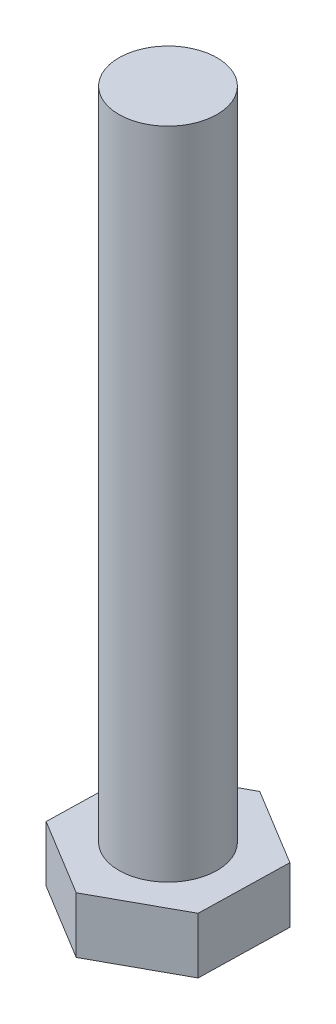
ISO-10303-21;
HEADER;
FILE_DESCRIPTION(('STEP AP214'),'2;1');
FILE_NAME('part.step','',(''),(''),'','','');
FILE_SCHEMA(('AUTOMOTIVE_DESIGN { 1 0 10303 214 1 1 1 1 }'));
ENDSEC;
DATA;
#1=APPLICATION_CONTEXT('core data for automotive mechanical design processes');
#2=APPLICATION_PROTOCOL_DEFINITION('international standard','automotive_design',2000,#1);
#3=PRODUCT_CONTEXT('',#1,'mechanical');
#4=PRODUCT('Part','Part','',(#3));
#5=PRODUCT_RELATED_PRODUCT_CATEGORY('part','',(#4));
#6=PRODUCT_DEFINITION_FORMATION('','',#4);
#7=PRODUCT_DEFINITION_CONTEXT('part definition',#1,'design');
#8=PRODUCT_DEFINITION('design','',#6,#7);
#9=PRODUCT_DEFINITION_SHAPE('','',#8);
#10=(LENGTH_UNIT() NAMED_UNIT(*) SI_UNIT(.MILLI.,.METRE.));
#11=(NAMED_UNIT(*) PLANE_ANGLE_UNIT() SI_UNIT($,.RADIAN.));
#12=(NAMED_UNIT(*) SI_UNIT($,.STERADIAN.) SOLID_ANGLE_UNIT());
#13=UNCERTAINTY_MEASURE_WITH_UNIT(LENGTH_MEASURE(1.E-05),#10,'distance_accuracy_value','');
#14=(GEOMETRIC_REPRESENTATION_CONTEXT(3) GLOBAL_UNCERTAINTY_ASSIGNED_CONTEXT((#13)) GLOBAL_UNIT_ASSIGNED_CONTEXT((#10,
#11,#12)) REPRESENTATION_CONTEXT('',''));
#15=CARTESIAN_POINT('',(0.,0.,0.));
#16=DIRECTION('',(0.,0.,1.));
#17=DIRECTION('',(1.,0.,0.));
#18=AXIS2_PLACEMENT_3D('',#15,#16,#17);
#19=CARTESIAN_POINT('',(0.,8.,0.));
#20=DIRECTION('',(0.,1.,0.));
#21=DIRECTION('',(0.,0.,1.));
#22=AXIS2_PLACEMENT_3D('',#19,#20,#21);
#23=PLANE('',#22);
#24=DIRECTION('',(0.87704358070201,0.,-0.4804108216406));
#25=VECTOR('',#24,1.);
#26=CARTESIAN_POINT('',(-0.246529994803016,8.,10.9668845300292));
#27=LINE('',#26,#25);
#28=CARTESIAN_POINT('',(-0.246529994803016,8.,10.9668845300292));
#29=VERTEX_POINT('',#28);
#30=CARTESIAN_POINT('',(9.37433560597435,8.,5.69694350330886));
#31=VERTEX_POINT('',#30);
#32=EDGE_CURVE('E118',#29,#31,#27,.T.);
#33=ORIENTED_EDGE('',*,*,#32,.T.);
#34=DIRECTION('',(0.0224738145572902,0.,-0.999747431934308));
#35=VECTOR('',#34,1.);
#36=CARTESIAN_POINT('',(9.37433560597435,8.,5.69694350330886));
#37=LINE('',#36,#35);
#38=CARTESIAN_POINT('',(9.62086560077736,8.,-5.26994102672035));
#39=VERTEX_POINT('',#38);
#40=EDGE_CURVE('E107',#31,#39,#37,.T.);
#41=ORIENTED_EDGE('',*,*,#40,.T.);
#42=DIRECTION('',(-0.85456976614472,0.,-0.519336610293708));
#43=VECTOR('',#42,1.);
#44=CARTESIAN_POINT('',(9.62086560077736,8.,-5.26994102672035));
#45=LINE('',#44,#43);
#46=CARTESIAN_POINT('',(0.246529994803018,8.,-10.9668845300292));
#47=VERTEX_POINT('',#46);
#48=EDGE_CURVE('E117',#39,#47,#45,.T.);
#49=ORIENTED_EDGE('',*,*,#48,.T.);
#50=DIRECTION('',(-0.87704358070201,0.,0.4804108216406));
#51=VECTOR('',#50,1.);
#52=CARTESIAN_POINT('',(0.246529994803018,8.,-10.9668845300292));
#53=LINE('',#52,#51);
#54=CARTESIAN_POINT('',(-9.37433560597434,8.,-5.69694350330886));
#55=VERTEX_POINT('',#54);
#56=EDGE_CURVE('E186',#47,#55,#53,.T.);
#57=ORIENTED_EDGE('',*,*,#56,.T.);
#58=DIRECTION('',(-0.0224738145572905,0.,0.999747431934308));
#59=VECTOR('',#58,1.);
#60=CARTESIAN_POINT('',(-9.37433560597434,8.,-5.69694350330886));
#61=LINE('',#60,#59);
#62=CARTESIAN_POINT('',(-9.62086560077736,8.,5.26994102672035));
#63=VERTEX_POINT('',#62);
#64=EDGE_CURVE('E188',#55,#63,#61,.T.);
#65=ORIENTED_EDGE('',*,*,#64,.T.);
#66=DIRECTION('',(0.85456976614472,0.,0.519336610293708));
#67=VECTOR('',#66,1.);
#68=CARTESIAN_POINT('',(-9.62086560077736,8.,5.26994102672035));
#69=LINE('',#68,#67);
#70=EDGE_CURVE('E123',#63,#29,#69,.T.);
#71=ORIENTED_EDGE('',*,*,#70,.T.);
#72=EDGE_LOOP('',(#33,#41,#49,#57,#65,#71));
#73=FACE_BOUND('',#72,.T.);
#74=CARTESIAN_POINT('',(0.,8.,0.));
#75=DIRECTION('',(0.,1.,0.));
#76=DIRECTION('',(0.,0.,1.));
#77=AXIS2_PLACEMENT_3D('',#74,#75,#76);
#78=CIRCLE('',#77,6.);
#79=CARTESIAN_POINT('',(0.,8.,6.));
#80=VERTEX_POINT('',#79);
#81=EDGE_CURVE('E174',#80,#80,#78,.T.);
#82=ORIENTED_EDGE('',*,*,#81,.F.);
#83=EDGE_LOOP('',(#82));
#84=FACE_BOUND('',#83,.T.);
#85=ADVANCED_FACE('F34',(#73,#84),#23,.T.);
#86=CARTESIAN_POINT('',(-0.246529994803016,8.,10.9668845300292));
#87=DIRECTION('',(-0.4804108216406,0.,-0.87704358070201));
#88=DIRECTION('',(-0.87704358070201,0.,0.4804108216406));
#89=AXIS2_PLACEMENT_3D('',#86,#87,#88);
#90=PLANE('',#89);
#91=DIRECTION('',(0.,-1.,0.));
#92=VECTOR('',#91,1.);
#93=CARTESIAN_POINT('',(-0.246529994803016,8.,10.9668845300292));
#94=LINE('',#93,#92);
#95=CARTESIAN_POINT('',(-0.246529994803016,1.15470053837925,10.9668845300292));
#96=VERTEX_POINT('',#95);
#97=EDGE_CURVE('E191',#29,#96,#94,.T.);
#98=ORIENTED_EDGE('',*,*,#97,.T.);
#99=DIRECTION('',(0.87704358070201,0.,-0.4804108216406));
#100=VECTOR('',#99,1.);
#101=CARTESIAN_POINT('',(-0.246529994803016,1.15470053837925,10.9668845300292));
#102=LINE('',#101,#100);
#103=CARTESIAN_POINT('',(9.37433560597435,1.15470053837925,5.69694350330886));
#104=VERTEX_POINT('',#103);
#105=EDGE_CURVE('E131',#96,#104,#102,.T.);
#106=ORIENTED_EDGE('',*,*,#105,.T.);
#107=DIRECTION('',(0.,-1.,0.));
#108=VECTOR('',#107,1.);
#109=CARTESIAN_POINT('',(9.37433560597435,8.,5.69694350330886));
#110=LINE('',#109,#108);
#111=EDGE_CURVE('E111',#31,#104,#110,.T.);
#112=ORIENTED_EDGE('',*,*,#111,.F.);
#113=ORIENTED_EDGE('',*,*,#32,.F.);
#114=EDGE_LOOP('',(#98,#106,#112,#113));
#115=FACE_BOUND('',#114,.T.);
#116=ADVANCED_FACE('F129',(#115),#90,.F.);
#117=CARTESIAN_POINT('',(9.37433560597435,8.,5.69694350330886));
#118=DIRECTION('',(-0.999747431934308,0.,-0.0224738145572902));
#119=DIRECTION('',(-0.0224738145572902,0.,0.999747431934308));
#120=AXIS2_PLACEMENT_3D('',#117,#118,#119);
#121=PLANE('',#120);
#122=ORIENTED_EDGE('',*,*,#111,.T.);
#123=DIRECTION('',(0.0224738145572902,0.,-0.999747431934308));
#124=VECTOR('',#123,1.);
#125=CARTESIAN_POINT('',(9.37433560597435,1.15470053837925,5.69694350330886));
#126=LINE('',#125,#124);
#127=CARTESIAN_POINT('',(9.62086560077736,1.15470053837925,-5.26994102672035));
#128=VERTEX_POINT('',#127);
#129=EDGE_CURVE('E153',#104,#128,#126,.T.);
#130=ORIENTED_EDGE('',*,*,#129,.T.);
#131=DIRECTION('',(0.,-1.,0.));
#132=VECTOR('',#131,1.);
#133=CARTESIAN_POINT('',(9.62086560077736,8.,-5.26994102672035));
#134=LINE('',#133,#132);
#135=EDGE_CURVE('E114',#39,#128,#134,.T.);
#136=ORIENTED_EDGE('',*,*,#135,.F.);
#137=ORIENTED_EDGE('',*,*,#40,.F.);
#138=EDGE_LOOP('',(#122,#130,#136,#137));
#139=FACE_BOUND('',#138,.T.);
#140=ADVANCED_FACE('F109',(#139),#121,.F.);
#141=CARTESIAN_POINT('',(9.62086560077736,8.,-5.26994102672035));
#142=DIRECTION('',(-0.519336610293708,0.,0.85456976614472));
#143=DIRECTION('',(0.85456976614472,0.,0.519336610293708));
#144=AXIS2_PLACEMENT_3D('',#141,#142,#143);
#145=PLANE('',#144);
#146=ORIENTED_EDGE('',*,*,#135,.T.);
#147=DIRECTION('',(-0.85456976614472,0.,-0.519336610293708));
#148=VECTOR('',#147,1.);
#149=CARTESIAN_POINT('',(9.62086560077736,1.15470053837925,-5.26994102672035));
#150=LINE('',#149,#148);
#151=CARTESIAN_POINT('',(0.246529994803018,1.15470053837925,-10.9668845300292));
#152=VERTEX_POINT('',#151);
#153=EDGE_CURVE('E132',#128,#152,#150,.T.);
#154=ORIENTED_EDGE('',*,*,#153,.T.);
#155=DIRECTION('',(0.,-1.,0.));
#156=VECTOR('',#155,1.);
#157=CARTESIAN_POINT('',(0.246529994803018,8.,-10.9668845300292));
#158=LINE('',#157,#156);
#159=EDGE_CURVE('E137',#47,#152,#158,.T.);
#160=ORIENTED_EDGE('',*,*,#159,.F.);
#161=ORIENTED_EDGE('',*,*,#48,.F.);
#162=EDGE_LOOP('',(#146,#154,#160,#161));
#163=FACE_BOUND('',#162,.T.);
#164=ADVANCED_FACE('F200',(#163),#145,.F.);
#165=CARTESIAN_POINT('',(0.246529994803018,8.,-10.9668845300292));
#166=DIRECTION('',(0.4804108216406,0.,0.87704358070201));
#167=DIRECTION('',(0.87704358070201,0.,-0.4804108216406));
#168=AXIS2_PLACEMENT_3D('',#165,#166,#167);
#169=PLANE('',#168);
#170=ORIENTED_EDGE('',*,*,#159,.T.);
#171=DIRECTION('',(-0.87704358070201,0.,0.4804108216406));
#172=VECTOR('',#171,1.);
#173=CARTESIAN_POINT('',(0.246529994803018,1.15470053837925,-10.9668845300292));
#174=LINE('',#173,#172);
#175=CARTESIAN_POINT('',(-9.37433560597434,1.15470053837925,-5.69694350330886));
#176=VERTEX_POINT('',#175);
#177=EDGE_CURVE('E11',#152,#176,#174,.T.);
#178=ORIENTED_EDGE('',*,*,#177,.T.);
#179=DIRECTION('',(0.,-1.,0.));
#180=VECTOR('',#179,1.);
#181=CARTESIAN_POINT('',(-9.37433560597434,8.,-5.69694350330886));
#182=LINE('',#181,#180);
#183=EDGE_CURVE('E195',#55,#176,#182,.T.);
#184=ORIENTED_EDGE('',*,*,#183,.F.);
#185=ORIENTED_EDGE('',*,*,#56,.F.);
#186=EDGE_LOOP('',(#170,#178,#184,#185));
#187=FACE_BOUND('',#186,.T.);
#188=ADVANCED_FACE('F198',(#187),#169,.F.);
#189=CARTESIAN_POINT('',(-9.37433560597434,8.,-5.69694350330886));
#190=DIRECTION('',(0.999747431934308,0.,0.0224738145572905));
#191=DIRECTION('',(0.0224738145572905,0.,-0.999747431934308));
#192=AXIS2_PLACEMENT_3D('',#189,#190,#191);
#193=PLANE('',#192);
#194=ORIENTED_EDGE('',*,*,#183,.T.);
#195=DIRECTION('',(-0.0224738145572905,0.,0.999747431934308));
#196=VECTOR('',#195,1.);
#197=CARTESIAN_POINT('',(-9.37433560597434,1.15470053837925,-5.69694350330886));
#198=LINE('',#197,#196);
#199=CARTESIAN_POINT('',(-9.62086560077736,1.15470053837925,5.26994102672035));
#200=VERTEX_POINT('',#199);
#201=EDGE_CURVE('E43',#176,#200,#198,.T.);
#202=ORIENTED_EDGE('',*,*,#201,.T.);
#203=DIRECTION('',(0.,-1.,0.));
#204=VECTOR('',#203,1.);
#205=CARTESIAN_POINT('',(-9.62086560077736,8.,5.26994102672035));
#206=LINE('',#205,#204);
#207=EDGE_CURVE('E193',#63,#200,#206,.T.);
#208=ORIENTED_EDGE('',*,*,#207,.F.);
#209=ORIENTED_EDGE('',*,*,#64,.F.);
#210=EDGE_LOOP('',(#194,#202,#208,#209));
#211=FACE_BOUND('',#210,.T.);
#212=ADVANCED_FACE('F221',(#211),#193,.F.);
#213=CARTESIAN_POINT('',(-9.62086560077736,8.,5.26994102672035));
#214=DIRECTION('',(0.519336610293708,0.,-0.85456976614472));
#215=DIRECTION('',(-0.85456976614472,0.,-0.519336610293708));
#216=AXIS2_PLACEMENT_3D('',#213,#214,#215);
#217=PLANE('',#216);
#218=ORIENTED_EDGE('',*,*,#207,.T.);
#219=DIRECTION('',(0.85456976614472,0.,0.519336610293708));
#220=VECTOR('',#219,1.);
#221=CARTESIAN_POINT('',(-9.62086560077736,1.15470053837925,5.26994102672035));
#222=LINE('',#221,#220);
#223=EDGE_CURVE('E156',#200,#96,#222,.T.);
#224=ORIENTED_EDGE('',*,*,#223,.T.);
#225=ORIENTED_EDGE('',*,*,#97,.F.);
#226=ORIENTED_EDGE('',*,*,#70,.F.);
#227=EDGE_LOOP('',(#218,#224,#225,#226));
#228=FACE_BOUND('',#227,.T.);
#229=ADVANCED_FACE('F219',(#228),#217,.F.);
#230=CARTESIAN_POINT('',(0.,0.,0.));
#231=DIRECTION('',(0.,1.,0.));
#232=DIRECTION('',(0.,0.,1.));
#233=AXIS2_PLACEMENT_3D('',#230,#231,#232);
#234=PLANE('',#233);
#235=DIRECTION('',(0.87704358070201,0.,-0.4804108216406));
#236=VECTOR('',#235,1.);
#237=CARTESIAN_POINT('',(-3.60308116230446,0.,-6.577826855265));
#238=LINE('',#237,#236);
#239=CARTESIAN_POINT('',(-7.40079126787446,0.,-4.49758697629645));
#240=VERTEX_POINT('',#239);
#241=CARTESIAN_POINT('',(0.194628943265541,0.,-8.65806673423355));
#242=VERTEX_POINT('',#241);
#243=EDGE_CURVE('E135',#240,#242,#238,.T.);
#244=ORIENTED_EDGE('',*,*,#243,.T.);
#245=DIRECTION('',(0.85456976614472,0.,0.519336610293708));
#246=VECTOR('',#245,1.);
#247=CARTESIAN_POINT('',(3.89502457720277,0.,-6.40927324608533));
#248=LINE('',#247,#246);
#249=CARTESIAN_POINT('',(7.59542021114,0.,-4.1604797579371));
#250=VERTEX_POINT('',#249);
#251=EDGE_CURVE('E150',#242,#250,#248,.T.);
#252=ORIENTED_EDGE('',*,*,#251,.T.);
#253=DIRECTION('',(-0.0224738145572902,0.,0.999747431934308));
#254=VECTOR('',#253,1.);
#255=CARTESIAN_POINT('',(7.49810573950723,0.,0.168553609179674));
#256=LINE('',#255,#254);
#257=CARTESIAN_POINT('',(7.40079126787446,0.,4.49758697629645));
#258=VERTEX_POINT('',#257);
#259=EDGE_CURVE('E148',#250,#258,#256,.T.);
#260=ORIENTED_EDGE('',*,*,#259,.T.);
#261=DIRECTION('',(-0.87704358070201,0.,0.4804108216406));
#262=VECTOR('',#261,1.);
#263=CARTESIAN_POINT('',(3.60308116230446,0.,6.577826855265));
#264=LINE('',#263,#262);
#265=CARTESIAN_POINT('',(-0.194628943265538,0.,8.65806673423355));
#266=VERTEX_POINT('',#265);
#267=EDGE_CURVE('E146',#258,#266,#264,.T.);
#268=ORIENTED_EDGE('',*,*,#267,.T.);
#269=DIRECTION('',(-0.85456976614472,0.,-0.519336610293708));
#270=VECTOR('',#269,1.);
#271=CARTESIAN_POINT('',(-3.89502457720277,0.,6.40927324608533));
#272=LINE('',#271,#270);
#273=CARTESIAN_POINT('',(-7.59542021114,0.,4.1604797579371));
#274=VERTEX_POINT('',#273);
#275=EDGE_CURVE('E144',#266,#274,#272,.T.);
#276=ORIENTED_EDGE('',*,*,#275,.T.);
#277=DIRECTION('',(0.0224738145572905,0.,-0.999747431934308));
#278=VECTOR('',#277,1.);
#279=CARTESIAN_POINT('',(-7.49810573950723,0.,-0.168553609179677));
#280=LINE('',#279,#278);
#281=EDGE_CURVE('E142',#274,#240,#280,.T.);
#282=ORIENTED_EDGE('',*,*,#281,.T.);
#283=EDGE_LOOP('',(#244,#252,#260,#268,#276,#282));
#284=FACE_BOUND('',#283,.T.);
#285=ADVANCED_FACE('F214',(#284),#234,.F.);
#286=CARTESIAN_POINT('',(0.,88.,0.));
#287=DIRECTION('',(0.,-1.,0.));
#288=DIRECTION('',(0.,0.,-1.));
#289=AXIS2_PLACEMENT_3D('',#286,#287,#288);
#290=CYLINDRICAL_SURFACE('',#289,6.);
#291=CARTESIAN_POINT('',(0.,88.,0.));
#292=DIRECTION('',(0.,1.,0.));
#293=DIRECTION('',(0.,0.,1.));
#294=AXIS2_PLACEMENT_3D('',#291,#292,#293);
#295=CIRCLE('',#294,6.);
#296=CARTESIAN_POINT('',(0.,88.,6.));
#297=VERTEX_POINT('',#296);
#298=EDGE_CURVE('E127',#297,#297,#295,.T.);
#299=ORIENTED_EDGE('',*,*,#298,.F.);
#300=EDGE_LOOP('',(#299));
#301=FACE_BOUND('',#300,.T.);
#302=ORIENTED_EDGE('',*,*,#81,.T.);
#303=EDGE_LOOP('',(#302));
#304=FACE_BOUND('',#303,.T.);
#305=ADVANCED_FACE('F238',(#301,#304),#290,.T.);
#306=CARTESIAN_POINT('',(0.,88.,0.));
#307=DIRECTION('',(0.,1.,0.));
#308=DIRECTION('',(0.,0.,1.));
#309=AXIS2_PLACEMENT_3D('',#306,#307,#308);
#310=PLANE('',#309);
#311=ORIENTED_EDGE('',*,*,#298,.T.);
#312=EDGE_LOOP('',(#311));
#313=FACE_BOUND('',#312,.T.);
#314=ADVANCED_FACE('F244',(#313),#310,.T.);
#315=CARTESIAN_POINT('',(-9.62086560077736,1.15470053837925,5.26994102672035));
#316=DIRECTION('',(0.259668305146852,0.866025403784441,-0.427284883072357));
#317=DIRECTION('',(0.85456976614472,0.,0.519336610293708));
#318=AXIS2_PLACEMENT_3D('',#315,#316,#317);
#319=PLANE('',#318);
#320=DIRECTION('',(-0.784451626271808,0.447213595499954,0.429692501725965));
#321=VECTOR('',#320,1.);
#322=CARTESIAN_POINT('',(-5.7725193604664,-1.0392304845413,3.16196461603219));
#323=LINE('',#322,#321);
#324=EDGE_CURVE('E168',#274,#200,#323,.T.);
#325=ORIENTED_EDGE('',*,*,#324,.F.);
#326=ORIENTED_EDGE('',*,*,#275,.F.);
#327=DIRECTION('',(-0.0201011908255309,0.447213595499954,0.894201287254385));
#328=VECTOR('',#327,1.);
#329=CARTESIAN_POINT('',(-0.147917996881805,-1.0392304845413,6.58013071801751));
#330=LINE('',#329,#328);
#331=EDGE_CURVE('E38',#96,#266,#330,.F.);
#332=ORIENTED_EDGE('',*,*,#331,.F.);
#333=ORIENTED_EDGE('',*,*,#223,.F.);
#334=EDGE_LOOP('',(#325,#326,#332,#333));
#335=FACE_BOUND('',#334,.T.);
#336=ADVANCED_FACE('F36',(#335),#319,.F.);
#337=CARTESIAN_POINT('',(-0.246529994803016,1.15470053837925,10.9668845300292));
#338=DIRECTION('',(-0.240205410820298,0.866025403784441,-0.438521790351002));
#339=DIRECTION('',(0.87704358070201,0.,-0.4804108216406));
#340=AXIS2_PLACEMENT_3D('',#337,#338,#339);
#341=PLANE('',#340);
#342=ORIENTED_EDGE('',*,*,#331,.T.);
#343=ORIENTED_EDGE('',*,*,#267,.F.);
#344=DIRECTION('',(0.764350435446278,0.447213595499954,0.46450878552842));
#345=VECTOR('',#344,1.);
#346=CARTESIAN_POINT('',(5.62460136358459,-1.0392304845413,3.41816610198531));
#347=LINE('',#346,#345);
#348=EDGE_CURVE('E166',#104,#258,#347,.F.);
#349=ORIENTED_EDGE('',*,*,#348,.F.);
#350=ORIENTED_EDGE('',*,*,#105,.F.);
#351=EDGE_LOOP('',(#342,#343,#349,#350));
#352=FACE_BOUND('',#351,.T.);
#353=ADVANCED_FACE('F254',(#352),#341,.F.);
#354=CARTESIAN_POINT('',(-9.37433560597434,1.15470053837925,-5.69694350330886));
#355=DIRECTION('',(0.49987371596715,0.866025403784441,0.0112369072786452));
#356=DIRECTION('',(-0.0224738145572905,0.,0.999747431934308));
#357=AXIS2_PLACEMENT_3D('',#354,#355,#356);
#358=PLANE('',#357);
#359=ORIENTED_EDGE('',*,*,#324,.T.);
#360=ORIENTED_EDGE('',*,*,#201,.F.);
#361=DIRECTION('',(-0.764350435446278,0.447213595499954,-0.464508785528421));
#362=VECTOR('',#361,1.);
#363=CARTESIAN_POINT('',(-5.62460136358459,-1.0392304845413,-3.41816610198531));
#364=LINE('',#363,#362);
#365=EDGE_CURVE('E163',#240,#176,#364,.T.);
#366=ORIENTED_EDGE('',*,*,#365,.F.);
#367=ORIENTED_EDGE('',*,*,#281,.F.);
#368=EDGE_LOOP('',(#359,#360,#366,#367));
#369=FACE_BOUND('',#368,.T.);
#370=ADVANCED_FACE('F212',(#369),#358,.F.);
#371=CARTESIAN_POINT('',(9.37433560597435,1.15470053837925,5.69694350330886));
#372=DIRECTION('',(-0.49987371596715,0.866025403784441,-0.011236907278645));
#373=DIRECTION('',(0.0224738145572902,0.,-0.999747431934308));
#374=AXIS2_PLACEMENT_3D('',#371,#372,#373);
#375=PLANE('',#374);
#376=ORIENTED_EDGE('',*,*,#348,.T.);
#377=ORIENTED_EDGE('',*,*,#259,.F.);
#378=DIRECTION('',(0.784451626271809,0.447213595499954,-0.429692501725965));
#379=VECTOR('',#378,1.);
#380=CARTESIAN_POINT('',(5.7725193604664,-1.0392304845413,-3.1619646160322));
#381=LINE('',#380,#379);
#382=EDGE_CURVE('E161',#128,#250,#381,.F.);
#383=ORIENTED_EDGE('',*,*,#382,.F.);
#384=ORIENTED_EDGE('',*,*,#129,.F.);
#385=EDGE_LOOP('',(#376,#377,#383,#384));
#386=FACE_BOUND('',#385,.T.);
#387=ADVANCED_FACE('F261',(#386),#375,.F.);
#388=CARTESIAN_POINT('',(0.246529994803018,1.15470053837925,-10.9668845300292));
#389=DIRECTION('',(0.240205410820298,0.866025403784441,0.438521790351002));
#390=DIRECTION('',(-0.87704358070201,0.,0.4804108216406));
#391=AXIS2_PLACEMENT_3D('',#388,#389,#390);
#392=PLANE('',#391);
#393=ORIENTED_EDGE('',*,*,#365,.T.);
#394=ORIENTED_EDGE('',*,*,#177,.F.);
#395=DIRECTION('',(-0.0201011908255303,-0.447213595499954,0.894201287254385));
#396=VECTOR('',#395,1.);
#397=CARTESIAN_POINT('',(0.246529994803019,1.15470053837925,-10.9668845300292));
#398=LINE('',#397,#396);
#399=EDGE_CURVE('E159',#242,#152,#398,.F.);
#400=ORIENTED_EDGE('',*,*,#399,.F.);
#401=ORIENTED_EDGE('',*,*,#243,.F.);
#402=EDGE_LOOP('',(#393,#394,#400,#401));
#403=FACE_BOUND('',#402,.T.);
#404=ADVANCED_FACE('F210',(#403),#392,.F.);
#405=CARTESIAN_POINT('',(9.62086560077736,1.15470053837925,-5.26994102672035));
#406=DIRECTION('',(-0.259668305146852,0.866025403784441,0.427284883072357));
#407=DIRECTION('',(-0.85456976614472,0.,-0.519336610293708));
#408=AXIS2_PLACEMENT_3D('',#405,#406,#407);
#409=PLANE('',#408);
#410=ORIENTED_EDGE('',*,*,#382,.T.);
#411=ORIENTED_EDGE('',*,*,#251,.F.);
#412=ORIENTED_EDGE('',*,*,#399,.T.);
#413=ORIENTED_EDGE('',*,*,#153,.F.);
#414=EDGE_LOOP('',(#410,#411,#412,#413));
#415=FACE_BOUND('',#414,.T.);
#416=ADVANCED_FACE('F204',(#415),#409,.F.);
#417=CLOSED_SHELL('',(#85,#116,#140,#164,#188,#212,#229,#285,#305,#314,#336,#353,#370,#387,#404,#416));
#418=MANIFOLD_SOLID_BREP('B2',#417);
#419=ADVANCED_BREP_SHAPE_REPRESENTATION('',(#18,#418),#14);
#420=SHAPE_DEFINITION_REPRESENTATION(#9,#419);
ENDSEC;
END-ISO-10303-21;
